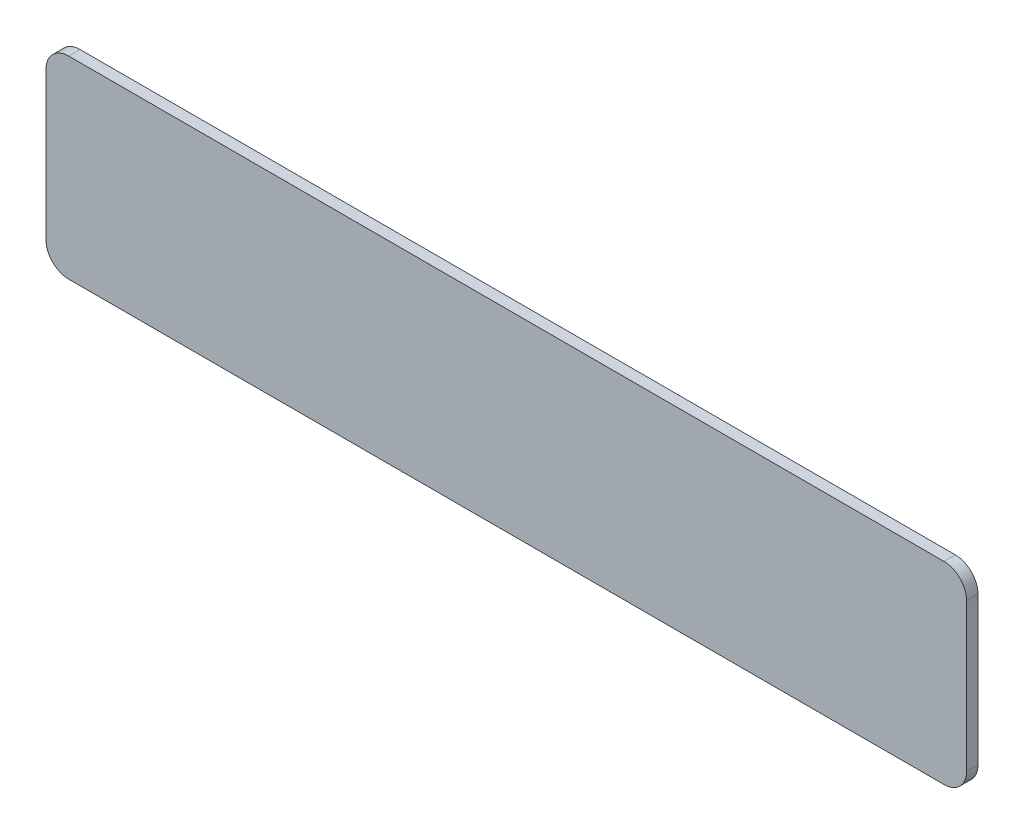
ISO-10303-21;
HEADER;
FILE_DESCRIPTION(('STEP AP214'),'2;1');
FILE_NAME('part.step','',(''),(''),'','','');
FILE_SCHEMA(('AUTOMOTIVE_DESIGN { 1 0 10303 214 1 1 1 1 }'));
ENDSEC;
DATA;
#1=APPLICATION_CONTEXT('core data for automotive mechanical design processes');
#2=APPLICATION_PROTOCOL_DEFINITION('international standard','automotive_design',2000,#1);
#3=PRODUCT_CONTEXT('',#1,'mechanical');
#4=PRODUCT('Part','Part','',(#3));
#5=PRODUCT_RELATED_PRODUCT_CATEGORY('part','',(#4));
#6=PRODUCT_DEFINITION_FORMATION('','',#4);
#7=PRODUCT_DEFINITION_CONTEXT('part definition',#1,'design');
#8=PRODUCT_DEFINITION('design','',#6,#7);
#9=PRODUCT_DEFINITION_SHAPE('','',#8);
#10=(LENGTH_UNIT() NAMED_UNIT(*) SI_UNIT(.MILLI.,.METRE.));
#11=(NAMED_UNIT(*) PLANE_ANGLE_UNIT() SI_UNIT($,.RADIAN.));
#12=(NAMED_UNIT(*) SI_UNIT($,.STERADIAN.) SOLID_ANGLE_UNIT());
#13=UNCERTAINTY_MEASURE_WITH_UNIT(LENGTH_MEASURE(1.E-05),#10,'distance_accuracy_value','');
#14=(GEOMETRIC_REPRESENTATION_CONTEXT(3) GLOBAL_UNCERTAINTY_ASSIGNED_CONTEXT((#13)) GLOBAL_UNIT_ASSIGNED_CONTEXT((#10,
#11,#12)) REPRESENTATION_CONTEXT('',''));
#15=CARTESIAN_POINT('',(0.,0.,0.));
#16=DIRECTION('',(0.,0.,1.));
#17=DIRECTION('',(1.,0.,0.));
#18=AXIS2_PLACEMENT_3D('',#15,#16,#17);
#19=CARTESIAN_POINT('',(38.5,6.50000000000001,1.));
#20=DIRECTION('',(0.,0.,-1.));
#21=DIRECTION('',(-1.,0.,0.));
#22=AXIS2_PLACEMENT_3D('',#19,#20,#21);
#23=CYLINDRICAL_SURFACE('',#22,2.);
#24=CARTESIAN_POINT('',(38.5,6.50000000000001,0.));
#25=DIRECTION('',(0.,0.,1.));
#26=DIRECTION('',(-1.,0.,0.));
#27=AXIS2_PLACEMENT_3D('',#24,#25,#26);
#28=CIRCLE('',#27,2.);
#29=CARTESIAN_POINT('',(40.5,6.49999999999999,0.));
#30=VERTEX_POINT('',#29);
#31=CARTESIAN_POINT('',(38.5,8.50000000000001,0.));
#32=VERTEX_POINT('',#31);
#33=EDGE_CURVE('E133',#30,#32,#28,.T.);
#34=ORIENTED_EDGE('',*,*,#33,.T.);
#35=DIRECTION('',(0.,0.,-1.));
#36=VECTOR('',#35,1.);
#37=CARTESIAN_POINT('',(38.5,8.50000000000001,1.));
#38=LINE('',#37,#36);
#39=CARTESIAN_POINT('',(38.5,8.50000000000001,1.));
#40=VERTEX_POINT('',#39);
#41=EDGE_CURVE('E11',#40,#32,#38,.T.);
#42=ORIENTED_EDGE('',*,*,#41,.F.);
#43=CARTESIAN_POINT('',(38.5,6.50000000000001,1.));
#44=DIRECTION('',(0.,0.,1.));
#45=DIRECTION('',(-1.,0.,0.));
#46=AXIS2_PLACEMENT_3D('',#43,#44,#45);
#47=CIRCLE('',#46,2.);
#48=CARTESIAN_POINT('',(40.5,6.49999999999999,1.));
#49=VERTEX_POINT('',#48);
#50=EDGE_CURVE('E147',#49,#40,#47,.T.);
#51=ORIENTED_EDGE('',*,*,#50,.F.);
#52=DIRECTION('',(0.,0.,-1.));
#53=VECTOR('',#52,1.);
#54=CARTESIAN_POINT('',(40.5,6.49999999999999,1.));
#55=LINE('',#54,#53);
#56=EDGE_CURVE('E129',#49,#30,#55,.T.);
#57=ORIENTED_EDGE('',*,*,#56,.T.);
#58=EDGE_LOOP('',(#34,#42,#51,#57));
#59=FACE_BOUND('',#58,.T.);
#60=ADVANCED_FACE('F37',(#59),#23,.T.);
#61=CARTESIAN_POINT('',(-38.5,8.50000000000001,1.));
#62=DIRECTION('',(0.,-1.,0.));
#63=DIRECTION('',(0.,0.,-1.));
#64=AXIS2_PLACEMENT_3D('',#61,#62,#63);
#65=PLANE('',#64);
#66=DIRECTION('',(-1.,0.,0.));
#67=VECTOR('',#66,1.);
#68=CARTESIAN_POINT('',(-38.5,8.50000000000001,0.));
#69=LINE('',#68,#67);
#70=CARTESIAN_POINT('',(-38.5,8.50000000000001,0.));
#71=VERTEX_POINT('',#70);
#72=EDGE_CURVE('E136',#32,#71,#69,.T.);
#73=ORIENTED_EDGE('',*,*,#72,.T.);
#74=DIRECTION('',(0.,0.,-1.));
#75=VECTOR('',#74,1.);
#76=CARTESIAN_POINT('',(-38.5,8.50000000000001,1.));
#77=LINE('',#76,#75);
#78=CARTESIAN_POINT('',(-38.5,8.50000000000001,1.));
#79=VERTEX_POINT('',#78);
#80=EDGE_CURVE('E45',#79,#71,#77,.T.);
#81=ORIENTED_EDGE('',*,*,#80,.F.);
#82=DIRECTION('',(-1.,0.,0.));
#83=VECTOR('',#82,1.);
#84=CARTESIAN_POINT('',(-38.5,8.50000000000001,1.));
#85=LINE('',#84,#83);
#86=EDGE_CURVE('E96',#40,#79,#85,.T.);
#87=ORIENTED_EDGE('',*,*,#86,.F.);
#88=ORIENTED_EDGE('',*,*,#41,.T.);
#89=EDGE_LOOP('',(#73,#81,#87,#88));
#90=FACE_BOUND('',#89,.T.);
#91=ADVANCED_FACE('F182',(#90),#65,.F.);
#92=CARTESIAN_POINT('',(-38.5,6.50000000000001,1.));
#93=DIRECTION('',(0.,0.,-1.));
#94=DIRECTION('',(-1.,0.,0.));
#95=AXIS2_PLACEMENT_3D('',#92,#93,#94);
#96=CYLINDRICAL_SURFACE('',#95,2.);
#97=CARTESIAN_POINT('',(-38.5,6.50000000000001,0.));
#98=DIRECTION('',(0.,0.,1.));
#99=DIRECTION('',(1.,0.,0.));
#100=AXIS2_PLACEMENT_3D('',#97,#98,#99);
#101=CIRCLE('',#100,2.);
#102=CARTESIAN_POINT('',(-40.5,6.49999999999999,0.));
#103=VERTEX_POINT('',#102);
#104=EDGE_CURVE('E138',#71,#103,#101,.T.);
#105=ORIENTED_EDGE('',*,*,#104,.T.);
#106=DIRECTION('',(0.,0.,-1.));
#107=VECTOR('',#106,1.);
#108=CARTESIAN_POINT('',(-40.5,6.49999999999999,1.));
#109=LINE('',#108,#107);
#110=CARTESIAN_POINT('',(-40.5,6.49999999999999,1.));
#111=VERTEX_POINT('',#110);
#112=EDGE_CURVE('E154',#111,#103,#109,.T.);
#113=ORIENTED_EDGE('',*,*,#112,.F.);
#114=CARTESIAN_POINT('',(-38.5,6.50000000000001,1.));
#115=DIRECTION('',(0.,0.,1.));
#116=DIRECTION('',(1.,0.,0.));
#117=AXIS2_PLACEMENT_3D('',#114,#115,#116);
#118=CIRCLE('',#117,2.);
#119=EDGE_CURVE('E162',#79,#111,#118,.T.);
#120=ORIENTED_EDGE('',*,*,#119,.F.);
#121=ORIENTED_EDGE('',*,*,#80,.T.);
#122=EDGE_LOOP('',(#105,#113,#120,#121));
#123=FACE_BOUND('',#122,.T.);
#124=ADVANCED_FACE('F160',(#123),#96,.T.);
#125=CARTESIAN_POINT('',(-40.5,6.49999999999999,1.));
#126=DIRECTION('',(1.,0.,0.));
#127=DIRECTION('',(0.,1.,0.));
#128=AXIS2_PLACEMENT_3D('',#125,#126,#127);
#129=PLANE('',#128);
#130=DIRECTION('',(0.,-1.,0.));
#131=VECTOR('',#130,1.);
#132=CARTESIAN_POINT('',(-40.5,6.49999999999999,0.));
#133=LINE('',#132,#131);
#134=CARTESIAN_POINT('',(-40.5,-6.49999999999998,0.));
#135=VERTEX_POINT('',#134);
#136=EDGE_CURVE('E140',#103,#135,#133,.T.);
#137=ORIENTED_EDGE('',*,*,#136,.T.);
#138=DIRECTION('',(0.,0.,-1.));
#139=VECTOR('',#138,1.);
#140=CARTESIAN_POINT('',(-40.5,-6.49999999999998,1.));
#141=LINE('',#140,#139);
#142=CARTESIAN_POINT('',(-40.5,-6.49999999999998,1.));
#143=VERTEX_POINT('',#142);
#144=EDGE_CURVE('E151',#143,#135,#141,.T.);
#145=ORIENTED_EDGE('',*,*,#144,.F.);
#146=DIRECTION('',(0.,-1.,0.));
#147=VECTOR('',#146,1.);
#148=CARTESIAN_POINT('',(-40.5,6.49999999999999,1.));
#149=LINE('',#148,#147);
#150=EDGE_CURVE('E174',#111,#143,#149,.T.);
#151=ORIENTED_EDGE('',*,*,#150,.F.);
#152=ORIENTED_EDGE('',*,*,#112,.T.);
#153=EDGE_LOOP('',(#137,#145,#151,#152));
#154=FACE_BOUND('',#153,.T.);
#155=ADVANCED_FACE('F170',(#154),#129,.F.);
#156=CARTESIAN_POINT('',(-38.5,-6.5,1.));
#157=DIRECTION('',(0.,0.,-1.));
#158=DIRECTION('',(-1.,0.,0.));
#159=AXIS2_PLACEMENT_3D('',#156,#157,#158);
#160=CYLINDRICAL_SURFACE('',#159,2.);
#161=CARTESIAN_POINT('',(-38.5,-6.5,0.));
#162=DIRECTION('',(0.,0.,1.));
#163=DIRECTION('',(1.,0.,0.));
#164=AXIS2_PLACEMENT_3D('',#161,#162,#163);
#165=CIRCLE('',#164,2.);
#166=CARTESIAN_POINT('',(-38.5,-8.5,0.));
#167=VERTEX_POINT('',#166);
#168=EDGE_CURVE('E142',#135,#167,#165,.T.);
#169=ORIENTED_EDGE('',*,*,#168,.T.);
#170=DIRECTION('',(0.,0.,-1.));
#171=VECTOR('',#170,1.);
#172=CARTESIAN_POINT('',(-38.5,-8.5,1.));
#173=LINE('',#172,#171);
#174=CARTESIAN_POINT('',(-38.5,-8.5,1.));
#175=VERTEX_POINT('',#174);
#176=EDGE_CURVE('E124',#175,#167,#173,.T.);
#177=ORIENTED_EDGE('',*,*,#176,.F.);
#178=CARTESIAN_POINT('',(-38.5,-6.5,1.));
#179=DIRECTION('',(0.,0.,1.));
#180=DIRECTION('',(1.,0.,0.));
#181=AXIS2_PLACEMENT_3D('',#178,#179,#180);
#182=CIRCLE('',#181,2.);
#183=EDGE_CURVE('E115',#143,#175,#182,.T.);
#184=ORIENTED_EDGE('',*,*,#183,.F.);
#185=ORIENTED_EDGE('',*,*,#144,.T.);
#186=EDGE_LOOP('',(#169,#177,#184,#185));
#187=FACE_BOUND('',#186,.T.);
#188=ADVANCED_FACE('F173',(#187),#160,.T.);
#189=CARTESIAN_POINT('',(-38.5,-8.49999999999999,1.));
#190=DIRECTION('',(0.,1.,0.));
#191=DIRECTION('',(0.,0.,1.));
#192=AXIS2_PLACEMENT_3D('',#189,#190,#191);
#193=PLANE('',#192);
#194=DIRECTION('',(1.,0.,0.));
#195=VECTOR('',#194,1.);
#196=CARTESIAN_POINT('',(-38.5,-8.49999999999999,0.));
#197=LINE('',#196,#195);
#198=CARTESIAN_POINT('',(38.5,-8.49999999999999,0.));
#199=VERTEX_POINT('',#198);
#200=EDGE_CURVE('E123',#167,#199,#197,.T.);
#201=ORIENTED_EDGE('',*,*,#200,.T.);
#202=DIRECTION('',(0.,0.,-1.));
#203=VECTOR('',#202,1.);
#204=CARTESIAN_POINT('',(38.5,-8.49999999999999,1.));
#205=LINE('',#204,#203);
#206=CARTESIAN_POINT('',(38.5,-8.49999999999999,1.));
#207=VERTEX_POINT('',#206);
#208=EDGE_CURVE('E120',#207,#199,#205,.T.);
#209=ORIENTED_EDGE('',*,*,#208,.F.);
#210=DIRECTION('',(1.,0.,0.));
#211=VECTOR('',#210,1.);
#212=CARTESIAN_POINT('',(-38.5,-8.49999999999999,1.));
#213=LINE('',#212,#211);
#214=EDGE_CURVE('E109',#175,#207,#213,.T.);
#215=ORIENTED_EDGE('',*,*,#214,.F.);
#216=ORIENTED_EDGE('',*,*,#176,.T.);
#217=EDGE_LOOP('',(#201,#209,#215,#216));
#218=FACE_BOUND('',#217,.T.);
#219=ADVANCED_FACE('F121',(#218),#193,.F.);
#220=CARTESIAN_POINT('',(38.5,-6.5,1.));
#221=DIRECTION('',(0.,0.,-1.));
#222=DIRECTION('',(-1.,0.,0.));
#223=AXIS2_PLACEMENT_3D('',#220,#221,#222);
#224=CYLINDRICAL_SURFACE('',#223,2.);
#225=CARTESIAN_POINT('',(38.5,-6.5,0.));
#226=DIRECTION('',(0.,0.,1.));
#227=DIRECTION('',(1.,0.,0.));
#228=AXIS2_PLACEMENT_3D('',#225,#226,#227);
#229=CIRCLE('',#228,2.);
#230=CARTESIAN_POINT('',(40.5,-6.5,0.));
#231=VERTEX_POINT('',#230);
#232=EDGE_CURVE('E82',#199,#231,#229,.T.);
#233=ORIENTED_EDGE('',*,*,#232,.T.);
#234=DIRECTION('',(0.,0.,-1.));
#235=VECTOR('',#234,1.);
#236=CARTESIAN_POINT('',(40.5,-6.5,1.));
#237=LINE('',#236,#235);
#238=CARTESIAN_POINT('',(40.5,-6.5,1.));
#239=VERTEX_POINT('',#238);
#240=EDGE_CURVE('E125',#239,#231,#237,.T.);
#241=ORIENTED_EDGE('',*,*,#240,.F.);
#242=CARTESIAN_POINT('',(38.5,-6.5,1.));
#243=DIRECTION('',(0.,0.,1.));
#244=DIRECTION('',(1.,0.,0.));
#245=AXIS2_PLACEMENT_3D('',#242,#243,#244);
#246=CIRCLE('',#245,2.);
#247=EDGE_CURVE('E113',#207,#239,#246,.T.);
#248=ORIENTED_EDGE('',*,*,#247,.F.);
#249=ORIENTED_EDGE('',*,*,#208,.T.);
#250=EDGE_LOOP('',(#233,#241,#248,#249));
#251=FACE_BOUND('',#250,.T.);
#252=ADVANCED_FACE('F127',(#251),#224,.T.);
#253=CARTESIAN_POINT('',(40.5,6.49999999999999,1.));
#254=DIRECTION('',(-1.,0.,0.));
#255=DIRECTION('',(0.,-1.,0.));
#256=AXIS2_PLACEMENT_3D('',#253,#254,#255);
#257=PLANE('',#256);
#258=DIRECTION('',(0.,1.,0.));
#259=VECTOR('',#258,1.);
#260=CARTESIAN_POINT('',(40.5,6.49999999999999,0.));
#261=LINE('',#260,#259);
#262=EDGE_CURVE('E88',#231,#30,#261,.T.);
#263=ORIENTED_EDGE('',*,*,#262,.T.);
#264=ORIENTED_EDGE('',*,*,#56,.F.);
#265=DIRECTION('',(0.,1.,0.));
#266=VECTOR('',#265,1.);
#267=CARTESIAN_POINT('',(40.5,6.49999999999999,1.));
#268=LINE('',#267,#266);
#269=EDGE_CURVE('E53',#239,#49,#268,.T.);
#270=ORIENTED_EDGE('',*,*,#269,.F.);
#271=ORIENTED_EDGE('',*,*,#240,.T.);
#272=EDGE_LOOP('',(#263,#264,#270,#271));
#273=FACE_BOUND('',#272,.T.);
#274=ADVANCED_FACE('F198',(#273),#257,.F.);
#275=CARTESIAN_POINT('',(38.5,6.50000000000001,1.));
#276=DIRECTION('',(0.,0.,-1.));
#277=DIRECTION('',(-1.,0.,0.));
#278=AXIS2_PLACEMENT_3D('',#275,#276,#277);
#279=PLANE('',#278);
#280=ORIENTED_EDGE('',*,*,#50,.T.);
#281=ORIENTED_EDGE('',*,*,#86,.T.);
#282=ORIENTED_EDGE('',*,*,#119,.T.);
#283=ORIENTED_EDGE('',*,*,#150,.T.);
#284=ORIENTED_EDGE('',*,*,#183,.T.);
#285=ORIENTED_EDGE('',*,*,#214,.T.);
#286=ORIENTED_EDGE('',*,*,#247,.T.);
#287=ORIENTED_EDGE('',*,*,#269,.T.);
#288=EDGE_LOOP('',(#280,#281,#282,#283,#284,#285,#286,#287));
#289=FACE_BOUND('',#288,.T.);
#290=ADVANCED_FACE('F111',(#289),#279,.F.);
#291=CARTESIAN_POINT('',(38.5,6.50000000000001,0.));
#292=DIRECTION('',(0.,0.,-1.));
#293=DIRECTION('',(-1.,0.,0.));
#294=AXIS2_PLACEMENT_3D('',#291,#292,#293);
#295=PLANE('',#294);
#296=ORIENTED_EDGE('',*,*,#33,.F.);
#297=ORIENTED_EDGE('',*,*,#262,.F.);
#298=ORIENTED_EDGE('',*,*,#232,.F.);
#299=ORIENTED_EDGE('',*,*,#200,.F.);
#300=ORIENTED_EDGE('',*,*,#168,.F.);
#301=ORIENTED_EDGE('',*,*,#136,.F.);
#302=ORIENTED_EDGE('',*,*,#104,.F.);
#303=ORIENTED_EDGE('',*,*,#72,.F.);
#304=EDGE_LOOP('',(#296,#297,#298,#299,#300,#301,#302,#303));
#305=FACE_BOUND('',#304,.T.);
#306=ADVANCED_FACE('F166',(#305),#295,.T.);
#307=CLOSED_SHELL('',(#60,#91,#124,#155,#188,#219,#252,#274,#290,#306));
#308=MANIFOLD_SOLID_BREP('B2',#307);
#309=ADVANCED_BREP_SHAPE_REPRESENTATION('',(#18,#308),#14);
#310=SHAPE_DEFINITION_REPRESENTATION(#9,#309);
ENDSEC;
END-ISO-10303-21;
